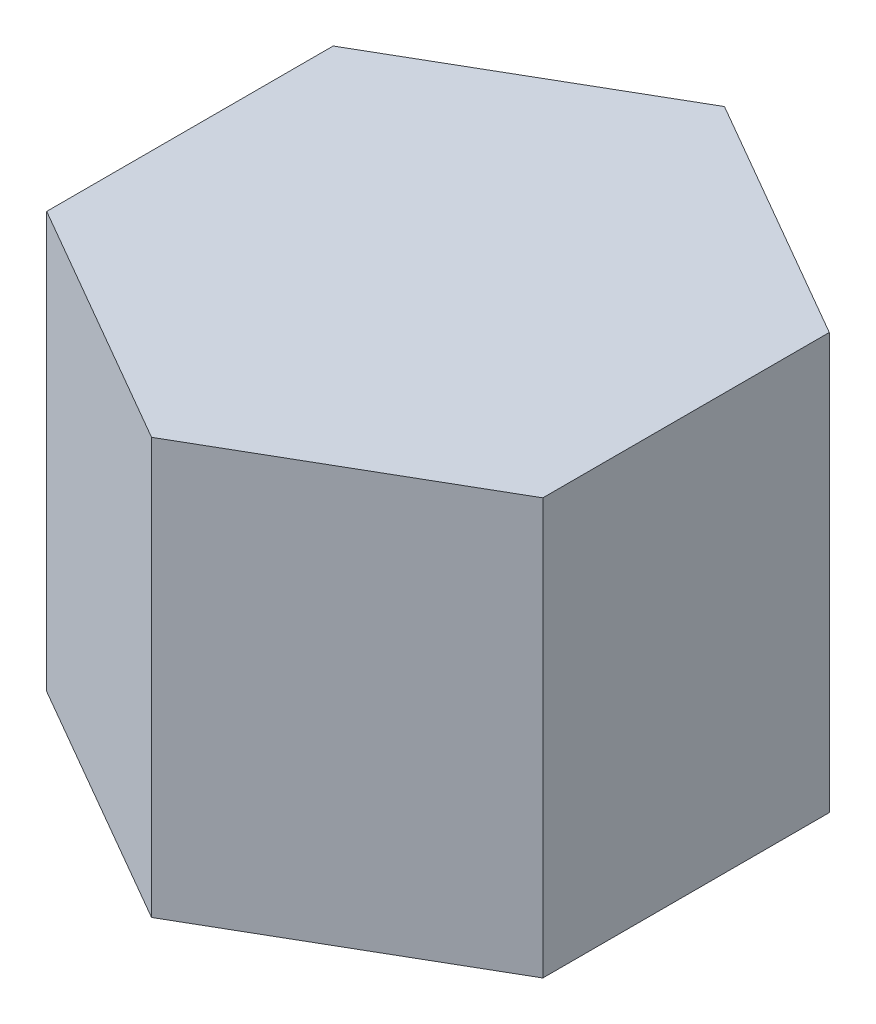
ISO-10303-21;
HEADER;
FILE_DESCRIPTION(('STEP AP214'),'2;1');
FILE_NAME('part.step','',(''),(''),'','','');
FILE_SCHEMA(('AUTOMOTIVE_DESIGN { 1 0 10303 214 1 1 1 1 }'));
ENDSEC;
DATA;
#1=APPLICATION_CONTEXT('core data for automotive mechanical design processes');
#2=APPLICATION_PROTOCOL_DEFINITION('international standard','automotive_design',2000,#1);
#3=PRODUCT_CONTEXT('',#1,'mechanical');
#4=PRODUCT('Part','Part','',(#3));
#5=PRODUCT_RELATED_PRODUCT_CATEGORY('part','',(#4));
#6=PRODUCT_DEFINITION_FORMATION('','',#4);
#7=PRODUCT_DEFINITION_CONTEXT('part definition',#1,'design');
#8=PRODUCT_DEFINITION('design','',#6,#7);
#9=PRODUCT_DEFINITION_SHAPE('','',#8);
#10=(LENGTH_UNIT() NAMED_UNIT(*) SI_UNIT(.MILLI.,.METRE.));
#11=(NAMED_UNIT(*) PLANE_ANGLE_UNIT() SI_UNIT($,.RADIAN.));
#12=(NAMED_UNIT(*) SI_UNIT($,.STERADIAN.) SOLID_ANGLE_UNIT());
#13=UNCERTAINTY_MEASURE_WITH_UNIT(LENGTH_MEASURE(1.E-05),#10,'distance_accuracy_value','');
#14=(GEOMETRIC_REPRESENTATION_CONTEXT(3) GLOBAL_UNCERTAINTY_ASSIGNED_CONTEXT((#13)) GLOBAL_UNIT_ASSIGNED_CONTEXT((#10,
#11,#12)) REPRESENTATION_CONTEXT('',''));
#15=CARTESIAN_POINT('',(0.,0.,0.));
#16=DIRECTION('',(0.,0.,1.));
#17=DIRECTION('',(1.,0.,0.));
#18=AXIS2_PLACEMENT_3D('',#15,#16,#17);
#19=CARTESIAN_POINT('',(207.142660308706,-148.537700895744,290.64094581671));
#20=DIRECTION('',(-0.499999999999909,0.,-0.866025403784491));
#21=DIRECTION('',(-0.866025403784491,0.,0.499999999999909));
#22=AXIS2_PLACEMENT_3D('',#19,#20,#21);
#23=PLANE('',#22);
#24=CARTESIAN_POINT('',(206.839551417382,-149.045793579175,290.81594581671));
#25=DIRECTION('',(0.866025403784491,0.,-0.499999999999909));
#26=VECTOR('',#25,1.);
#27=LINE('',#24,#26);
#28=CARTESIAN_POINT('',(206.839551417382,-149.045793579175,290.81594581671));
#29=VERTEX_POINT('',#28);
#30=CARTESIAN_POINT('',(207.142660308706,-149.045793579175,290.64094581671));
#31=VERTEX_POINT('',#30);
#32=EDGE_CURVE('E170',#29,#31,#27,.T.);
#33=ORIENTED_EDGE('',*,*,#32,.T.);
#34=CARTESIAN_POINT('',(207.142660308706,-148.537700895744,290.64094581671));
#35=DIRECTION('',(0.,-1.,0.));
#36=VECTOR('',#35,1.);
#37=LINE('',#34,#36);
#38=CARTESIAN_POINT('',(207.142660308706,-148.537700895744,290.64094581671));
#39=VERTEX_POINT('',#38);
#40=EDGE_CURVE('E35',#39,#31,#37,.T.);
#41=ORIENTED_EDGE('',*,*,#40,.F.);
#42=CARTESIAN_POINT('',(206.839551417382,-148.537700895744,290.81594581671));
#43=DIRECTION('',(0.866025403784491,0.,-0.499999999999909));
#44=VECTOR('',#43,1.);
#45=LINE('',#42,#44);
#46=CARTESIAN_POINT('',(206.839551417382,-148.537700895744,290.81594581671));
#47=VERTEX_POINT('',#46);
#48=EDGE_CURVE('E159',#47,#39,#45,.T.);
#49=ORIENTED_EDGE('',*,*,#48,.F.);
#50=CARTESIAN_POINT('',(206.839551417382,-148.537700895744,290.81594581671));
#51=DIRECTION('',(0.,-1.,0.));
#52=VECTOR('',#51,1.);
#53=LINE('',#50,#52);
#54=EDGE_CURVE('E10',#47,#29,#53,.T.);
#55=ORIENTED_EDGE('',*,*,#54,.T.);
#56=EDGE_LOOP('',(#33,#41,#49,#55));
#57=FACE_BOUND('',#56,.T.);
#58=ADVANCED_FACE('F16',(#57),#23,.F.);
#59=CARTESIAN_POINT('',(206.839551417382,-148.537700895744,290.81594581671));
#60=DIRECTION('',(0.500000000000062,0.,-0.866025403784403));
#61=DIRECTION('',(-0.866025403784403,0.,-0.500000000000062));
#62=AXIS2_PLACEMENT_3D('',#59,#60,#61);
#63=PLANE('',#62);
#64=CARTESIAN_POINT('',(206.536442526057,-149.045793579175,290.64094581671));
#65=DIRECTION('',(0.866025403784403,0.,0.500000000000062));
#66=VECTOR('',#65,1.);
#67=LINE('',#64,#66);
#68=CARTESIAN_POINT('',(206.536442526057,-149.045793579175,290.64094581671));
#69=VERTEX_POINT('',#68);
#70=EDGE_CURVE('E167',#69,#29,#67,.T.);
#71=ORIENTED_EDGE('',*,*,#70,.T.);
#72=ORIENTED_EDGE('',*,*,#54,.F.);
#73=CARTESIAN_POINT('',(206.536442526057,-148.537700895744,290.64094581671));
#74=DIRECTION('',(0.866025403784403,0.,0.500000000000062));
#75=VECTOR('',#74,1.);
#76=LINE('',#73,#75);
#77=CARTESIAN_POINT('',(206.536442526057,-148.537700895744,290.64094581671));
#78=VERTEX_POINT('',#77);
#79=EDGE_CURVE('E156',#78,#47,#76,.T.);
#80=ORIENTED_EDGE('',*,*,#79,.F.);
#81=CARTESIAN_POINT('',(206.536442526057,-148.537700895744,290.64094581671));
#82=DIRECTION('',(0.,-1.,0.));
#83=VECTOR('',#82,1.);
#84=LINE('',#81,#83);
#85=EDGE_CURVE('E27',#78,#69,#84,.T.);
#86=ORIENTED_EDGE('',*,*,#85,.T.);
#87=EDGE_LOOP('',(#71,#72,#80,#86));
#88=FACE_BOUND('',#87,.T.);
#89=ADVANCED_FACE('F189',(#88),#63,.F.);
#90=CARTESIAN_POINT('',(206.536442526057,-148.537700895744,290.831971220494));
#91=DIRECTION('',(1.,0.,0.));
#92=DIRECTION('',(0.,1.,0.));
#93=AXIS2_PLACEMENT_3D('',#90,#91,#92);
#94=PLANE('',#93);
#95=CARTESIAN_POINT('',(206.536442526057,-149.045793579175,290.29094581671));
#96=DIRECTION('',(0.,0.,1.));
#97=VECTOR('',#96,1.);
#98=LINE('',#95,#97);
#99=CARTESIAN_POINT('',(206.536442526057,-149.045793579175,290.29094581671));
#100=VERTEX_POINT('',#99);
#101=EDGE_CURVE('E163',#100,#69,#98,.T.);
#102=ORIENTED_EDGE('',*,*,#101,.T.);
#103=ORIENTED_EDGE('',*,*,#85,.F.);
#104=CARTESIAN_POINT('',(206.536442526057,-148.537700895744,290.29094581671));
#105=DIRECTION('',(0.,0.,1.));
#106=VECTOR('',#105,1.);
#107=LINE('',#104,#106);
#108=CARTESIAN_POINT('',(206.536442526057,-148.537700895744,290.29094581671));
#109=VERTEX_POINT('',#108);
#110=EDGE_CURVE('E106',#109,#78,#107,.T.);
#111=ORIENTED_EDGE('',*,*,#110,.F.);
#112=CARTESIAN_POINT('',(206.536442526057,-148.537700895744,290.29094581671));
#113=DIRECTION('',(0.,-1.,0.));
#114=VECTOR('',#113,1.);
#115=LINE('',#112,#114);
#116=EDGE_CURVE('E94',#109,#100,#115,.T.);
#117=ORIENTED_EDGE('',*,*,#116,.T.);
#118=EDGE_LOOP('',(#102,#103,#111,#117));
#119=FACE_BOUND('',#118,.T.);
#120=ADVANCED_FACE('F198',(#119),#94,.F.);
#121=CARTESIAN_POINT('',(206.536442526057,-148.537700895744,290.29094581671));
#122=DIRECTION('',(0.499999999999943,0.,0.866025403784472));
#123=DIRECTION('',(0.866025403784472,0.,-0.499999999999943));
#124=AXIS2_PLACEMENT_3D('',#121,#122,#123);
#125=PLANE('',#124);
#126=CARTESIAN_POINT('',(206.839551417382,-149.045793579175,290.11594581671));
#127=DIRECTION('',(-0.866025403784471,0.,0.499999999999943));
#128=VECTOR('',#127,1.);
#129=LINE('',#126,#128);
#130=CARTESIAN_POINT('',(206.839551417382,-149.045793579175,290.11594581671));
#131=VERTEX_POINT('',#130);
#132=EDGE_CURVE('E162',#131,#100,#129,.T.);
#133=ORIENTED_EDGE('',*,*,#132,.T.);
#134=ORIENTED_EDGE('',*,*,#116,.F.);
#135=CARTESIAN_POINT('',(206.839551417382,-148.537700895744,290.11594581671));
#136=DIRECTION('',(-0.866025403784471,0.,0.499999999999943));
#137=VECTOR('',#136,1.);
#138=LINE('',#135,#137);
#139=CARTESIAN_POINT('',(206.839551417382,-148.537700895744,290.11594581671));
#140=VERTEX_POINT('',#139);
#141=EDGE_CURVE('E98',#140,#109,#138,.T.);
#142=ORIENTED_EDGE('',*,*,#141,.F.);
#143=CARTESIAN_POINT('',(206.839551417382,-148.537700895744,290.11594581671));
#144=DIRECTION('',(0.,-1.,0.));
#145=VECTOR('',#144,1.);
#146=LINE('',#143,#145);
#147=EDGE_CURVE('E79',#140,#131,#146,.T.);
#148=ORIENTED_EDGE('',*,*,#147,.T.);
#149=EDGE_LOOP('',(#133,#134,#142,#148));
#150=FACE_BOUND('',#149,.T.);
#151=ADVANCED_FACE('F100',(#150),#125,.F.);
#152=CARTESIAN_POINT('',(206.839551417382,-148.537700895744,290.11594581671));
#153=DIRECTION('',(-0.500000000000062,0.,0.866025403784403));
#154=DIRECTION('',(0.866025403784403,0.,0.500000000000062));
#155=AXIS2_PLACEMENT_3D('',#152,#153,#154);
#156=PLANE('',#155);
#157=CARTESIAN_POINT('',(207.142660308706,-149.045793579175,290.29094581671));
#158=DIRECTION('',(-0.866025403784403,0.,-0.500000000000062));
#159=VECTOR('',#158,1.);
#160=LINE('',#157,#159);
#161=CARTESIAN_POINT('',(207.142660308706,-149.045793579175,290.29094581671));
#162=VERTEX_POINT('',#161);
#163=EDGE_CURVE('E88',#162,#131,#160,.T.);
#164=ORIENTED_EDGE('',*,*,#163,.T.);
#165=ORIENTED_EDGE('',*,*,#147,.F.);
#166=CARTESIAN_POINT('',(207.142660308706,-148.537700895744,290.29094581671));
#167=DIRECTION('',(-0.866025403784403,0.,-0.500000000000062));
#168=VECTOR('',#167,1.);
#169=LINE('',#166,#168);
#170=CARTESIAN_POINT('',(207.142660308706,-148.537700895744,290.29094581671));
#171=VERTEX_POINT('',#170);
#172=EDGE_CURVE('E84',#171,#140,#169,.T.);
#173=ORIENTED_EDGE('',*,*,#172,.F.);
#174=CARTESIAN_POINT('',(207.142660308706,-148.537700895744,290.29094581671));
#175=DIRECTION('',(0.,-1.,0.));
#176=VECTOR('',#175,1.);
#177=LINE('',#174,#176);
#178=EDGE_CURVE('E58',#171,#162,#177,.T.);
#179=ORIENTED_EDGE('',*,*,#178,.T.);
#180=EDGE_LOOP('',(#164,#165,#173,#179));
#181=FACE_BOUND('',#180,.T.);
#182=ADVANCED_FACE('F82',(#181),#156,.F.);
#183=CARTESIAN_POINT('',(207.142660308706,-148.537700895744,290.831971220494));
#184=DIRECTION('',(-1.,0.,0.));
#185=DIRECTION('',(0.,-1.,0.));
#186=AXIS2_PLACEMENT_3D('',#183,#184,#185);
#187=PLANE('',#186);
#188=CARTESIAN_POINT('',(207.142660308706,-149.045793579175,290.64094581671));
#189=DIRECTION('',(0.,0.,-1.));
#190=VECTOR('',#189,1.);
#191=LINE('',#188,#190);
#192=EDGE_CURVE('E160',#31,#162,#191,.T.);
#193=ORIENTED_EDGE('',*,*,#192,.T.);
#194=ORIENTED_EDGE('',*,*,#178,.F.);
#195=CARTESIAN_POINT('',(207.142660308706,-148.537700895744,290.64094581671));
#196=DIRECTION('',(0.,0.,-1.));
#197=VECTOR('',#196,1.);
#198=LINE('',#195,#197);
#199=EDGE_CURVE('E112',#39,#171,#198,.T.);
#200=ORIENTED_EDGE('',*,*,#199,.F.);
#201=ORIENTED_EDGE('',*,*,#40,.T.);
#202=EDGE_LOOP('',(#193,#194,#200,#201));
#203=FACE_BOUND('',#202,.T.);
#204=ADVANCED_FACE('F131',(#203),#187,.F.);
#205=CARTESIAN_POINT('',(206.339551417382,-148.537700895744,290.831971220494));
#206=DIRECTION('',(0.,-1.,0.));
#207=DIRECTION('',(1.,0.,0.));
#208=AXIS2_PLACEMENT_3D('',#205,#206,#207);
#209=PLANE('',#208);
#210=ORIENTED_EDGE('',*,*,#48,.T.);
#211=ORIENTED_EDGE('',*,*,#199,.T.);
#212=ORIENTED_EDGE('',*,*,#172,.T.);
#213=ORIENTED_EDGE('',*,*,#141,.T.);
#214=ORIENTED_EDGE('',*,*,#110,.T.);
#215=ORIENTED_EDGE('',*,*,#79,.T.);
#216=EDGE_LOOP('',(#210,#211,#212,#213,#214,#215));
#217=FACE_BOUND('',#216,.T.);
#218=ADVANCED_FACE('F111',(#217),#209,.F.);
#219=CARTESIAN_POINT('',(206.339551417382,-149.045793579175,290.831971220494));
#220=DIRECTION('',(0.,-1.,0.));
#221=DIRECTION('',(1.,0.,0.));
#222=AXIS2_PLACEMENT_3D('',#219,#220,#221);
#223=PLANE('',#222);
#224=ORIENTED_EDGE('',*,*,#32,.F.);
#225=ORIENTED_EDGE('',*,*,#70,.F.);
#226=ORIENTED_EDGE('',*,*,#101,.F.);
#227=ORIENTED_EDGE('',*,*,#132,.F.);
#228=ORIENTED_EDGE('',*,*,#163,.F.);
#229=ORIENTED_EDGE('',*,*,#192,.F.);
#230=EDGE_LOOP('',(#224,#225,#226,#227,#228,#229));
#231=FACE_BOUND('',#230,.T.);
#232=ADVANCED_FACE('F130',(#231),#223,.T.);
#233=CLOSED_SHELL('',(#58,#89,#120,#151,#182,#204,#218,#232));
#234=MANIFOLD_SOLID_BREP('B1',#233);
#235=ADVANCED_BREP_SHAPE_REPRESENTATION('',(#18,#234),#14);
#236=SHAPE_DEFINITION_REPRESENTATION(#9,#235);
ENDSEC;
END-ISO-10303-21;
